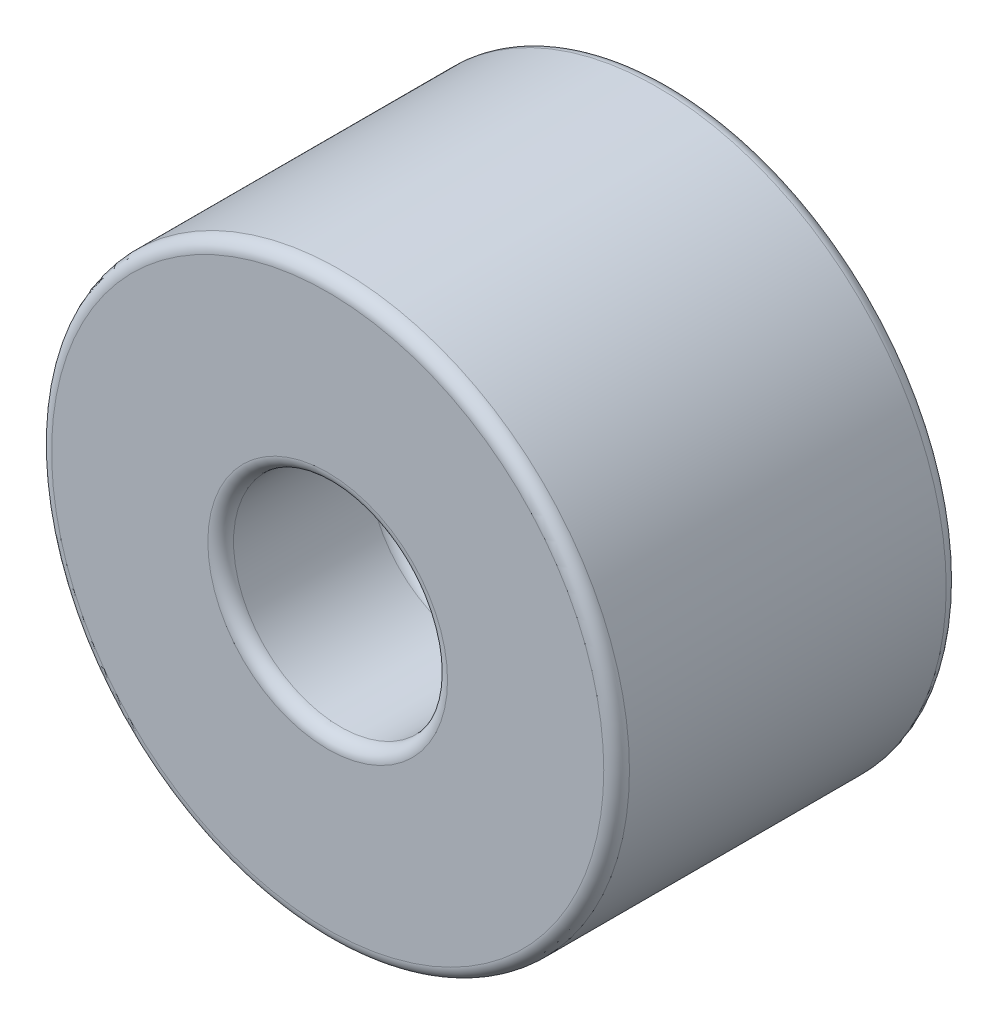
ISO-10303-21;
HEADER;
FILE_DESCRIPTION(('STEP AP214'),'2;1');
FILE_NAME('part.step','',(''),(''),'','','');
FILE_SCHEMA(('AUTOMOTIVE_DESIGN { 1 0 10303 214 1 1 1 1 }'));
ENDSEC;
DATA;
#1=APPLICATION_CONTEXT('core data for automotive mechanical design processes');
#2=APPLICATION_PROTOCOL_DEFINITION('international standard','automotive_design',2000,#1);
#3=PRODUCT_CONTEXT('',#1,'mechanical');
#4=PRODUCT('Part','Part','',(#3));
#5=PRODUCT_RELATED_PRODUCT_CATEGORY('part','',(#4));
#6=PRODUCT_DEFINITION_FORMATION('','',#4);
#7=PRODUCT_DEFINITION_CONTEXT('part definition',#1,'design');
#8=PRODUCT_DEFINITION('design','',#6,#7);
#9=PRODUCT_DEFINITION_SHAPE('','',#8);
#10=(LENGTH_UNIT() NAMED_UNIT(*) SI_UNIT(.MILLI.,.METRE.));
#11=(NAMED_UNIT(*) PLANE_ANGLE_UNIT() SI_UNIT($,.RADIAN.));
#12=(NAMED_UNIT(*) SI_UNIT($,.STERADIAN.) SOLID_ANGLE_UNIT());
#13=UNCERTAINTY_MEASURE_WITH_UNIT(LENGTH_MEASURE(1.E-05),#10,'distance_accuracy_value','');
#14=(GEOMETRIC_REPRESENTATION_CONTEXT(3) GLOBAL_UNCERTAINTY_ASSIGNED_CONTEXT((#13)) GLOBAL_UNIT_ASSIGNED_CONTEXT((#10,
#11,#12)) REPRESENTATION_CONTEXT('',''));
#15=CARTESIAN_POINT('',(0.,0.,0.));
#16=DIRECTION('',(0.,0.,1.));
#17=DIRECTION('',(1.,0.,0.));
#18=AXIS2_PLACEMENT_3D('',#15,#16,#17);
#19=CARTESIAN_POINT('',(0.,0.,160.));
#20=DIRECTION('',(0.,0.,-1.));
#21=DIRECTION('',(-1.,0.,0.));
#22=AXIS2_PLACEMENT_3D('',#19,#20,#21);
#23=CYLINDRICAL_SURFACE('',#22,135.);
#24=CARTESIAN_POINT('',(0.,0.,6.00000000000001));
#25=DIRECTION('',(0.,0.,1.));
#26=DIRECTION('',(1.,0.,0.));
#27=AXIS2_PLACEMENT_3D('',#24,#25,#26);
#28=CIRCLE('',#27,135.);
#29=CARTESIAN_POINT('',(135.,0.,6.00000000000001));
#30=VERTEX_POINT('',#29);
#31=EDGE_CURVE('E39',#30,#30,#28,.T.);
#32=ORIENTED_EDGE('',*,*,#31,.T.);
#33=EDGE_LOOP('',(#32));
#34=FACE_BOUND('',#33,.T.);
#35=CARTESIAN_POINT('',(0.,0.,154.));
#36=DIRECTION('',(0.,0.,1.));
#37=DIRECTION('',(1.,0.,0.));
#38=AXIS2_PLACEMENT_3D('',#35,#36,#37);
#39=CIRCLE('',#38,135.);
#40=CARTESIAN_POINT('',(135.,0.,154.));
#41=VERTEX_POINT('',#40);
#42=EDGE_CURVE('E44',#41,#41,#39,.F.);
#43=ORIENTED_EDGE('',*,*,#42,.T.);
#44=EDGE_LOOP('',(#43));
#45=FACE_BOUND('',#44,.T.);
#46=ADVANCED_FACE('F31',(#34,#45),#23,.T.);
#47=CARTESIAN_POINT('',(0.,0.,160.));
#48=DIRECTION('',(0.,0.,1.));
#49=DIRECTION('',(1.,0.,0.));
#50=AXIS2_PLACEMENT_3D('',#47,#48,#49);
#51=PLANE('',#50);
#52=CARTESIAN_POINT('',(0.,0.,160.));
#53=DIRECTION('',(0.,0.,1.));
#54=DIRECTION('',(1.,0.,0.));
#55=AXIS2_PLACEMENT_3D('',#52,#53,#54);
#56=CIRCLE('',#55,56.);
#57=CARTESIAN_POINT('',(56.,0.,160.));
#58=VERTEX_POINT('',#57);
#59=EDGE_CURVE('E81',#58,#58,#56,.F.);
#60=ORIENTED_EDGE('',*,*,#59,.T.);
#61=EDGE_LOOP('',(#60));
#62=FACE_BOUND('',#61,.T.);
#63=CARTESIAN_POINT('',(0.,0.,160.));
#64=DIRECTION('',(0.,0.,1.));
#65=DIRECTION('',(1.,0.,0.));
#66=AXIS2_PLACEMENT_3D('',#63,#64,#65);
#67=CIRCLE('',#66,129.);
#68=CARTESIAN_POINT('',(129.,0.,160.));
#69=VERTEX_POINT('',#68);
#70=EDGE_CURVE('E78',#69,#69,#67,.T.);
#71=ORIENTED_EDGE('',*,*,#70,.T.);
#72=EDGE_LOOP('',(#71));
#73=FACE_BOUND('',#72,.T.);
#74=ADVANCED_FACE('F108',(#62,#73),#51,.T.);
#75=CARTESIAN_POINT('',(0.,0.,0.));
#76=DIRECTION('',(0.,0.,1.));
#77=DIRECTION('',(1.,0.,0.));
#78=AXIS2_PLACEMENT_3D('',#75,#76,#77);
#79=PLANE('',#78);
#80=CARTESIAN_POINT('',(0.,0.,0.));
#81=DIRECTION('',(0.,0.,1.));
#82=DIRECTION('',(1.,0.,0.));
#83=AXIS2_PLACEMENT_3D('',#80,#81,#82);
#84=CIRCLE('',#83,56.);
#85=CARTESIAN_POINT('',(56.,0.,0.));
#86=VERTEX_POINT('',#85);
#87=EDGE_CURVE('E96',#86,#86,#84,.T.);
#88=ORIENTED_EDGE('',*,*,#87,.T.);
#89=EDGE_LOOP('',(#88));
#90=FACE_BOUND('',#89,.T.);
#91=CARTESIAN_POINT('',(0.,0.,0.));
#92=DIRECTION('',(0.,0.,1.));
#93=DIRECTION('',(1.,0.,0.));
#94=AXIS2_PLACEMENT_3D('',#91,#92,#93);
#95=CIRCLE('',#94,129.);
#96=CARTESIAN_POINT('',(129.,0.,0.));
#97=VERTEX_POINT('',#96);
#98=EDGE_CURVE('E93',#97,#97,#95,.F.);
#99=ORIENTED_EDGE('',*,*,#98,.T.);
#100=EDGE_LOOP('',(#99));
#101=FACE_BOUND('',#100,.T.);
#102=ADVANCED_FACE('F110',(#90,#101),#79,.F.);
#103=CARTESIAN_POINT('',(0.,0.,85.));
#104=DIRECTION('',(0.,0.,1.));
#105=DIRECTION('',(1.,0.,0.));
#106=AXIS2_PLACEMENT_3D('',#103,#104,#105);
#107=CYLINDRICAL_SURFACE('',#106,50.);
#108=CARTESIAN_POINT('',(0.,0.,154.));
#109=DIRECTION('',(0.,0.,1.));
#110=DIRECTION('',(1.,0.,0.));
#111=AXIS2_PLACEMENT_3D('',#108,#109,#110);
#112=CIRCLE('',#111,50.);
#113=CARTESIAN_POINT('',(50.,0.,154.));
#114=VERTEX_POINT('',#113);
#115=EDGE_CURVE('E75',#114,#114,#112,.T.);
#116=ORIENTED_EDGE('',*,*,#115,.T.);
#117=EDGE_LOOP('',(#116));
#118=FACE_BOUND('',#117,.T.);
#119=CARTESIAN_POINT('',(0.,0.,91.));
#120=DIRECTION('',(0.,0.,1.));
#121=DIRECTION('',(1.,0.,0.));
#122=AXIS2_PLACEMENT_3D('',#119,#120,#121);
#123=CIRCLE('',#122,50.);
#124=CARTESIAN_POINT('',(50.,0.,91.));
#125=VERTEX_POINT('',#124);
#126=EDGE_CURVE('E51',#125,#125,#123,.F.);
#127=ORIENTED_EDGE('',*,*,#126,.T.);
#128=EDGE_LOOP('',(#127));
#129=FACE_BOUND('',#128,.T.);
#130=ADVANCED_FACE('F117',(#118,#129),#107,.F.);
#131=CARTESIAN_POINT('',(0.,0.,85.));
#132=DIRECTION('',(0.,0.,1.));
#133=DIRECTION('',(1.,0.,0.));
#134=AXIS2_PLACEMENT_3D('',#131,#132,#133);
#135=PLANE('',#134);
#136=CARTESIAN_POINT('',(0.,0.,85.));
#137=DIRECTION('',(0.,0.,1.));
#138=DIRECTION('',(1.,0.,0.));
#139=AXIS2_PLACEMENT_3D('',#136,#137,#138);
#140=CIRCLE('',#139,6.5);
#141=CARTESIAN_POINT('',(6.5,0.,85.));
#142=VERTEX_POINT('',#141);
#143=EDGE_CURVE('E68',#142,#142,#140,.T.);
#144=ORIENTED_EDGE('',*,*,#143,.F.);
#145=EDGE_LOOP('',(#144));
#146=FACE_BOUND('',#145,.T.);
#147=CARTESIAN_POINT('',(-17.4999999999997,30.3108891324555,85.));
#148=DIRECTION('',(0.,0.,1.));
#149=DIRECTION('',(1.,0.,0.));
#150=AXIS2_PLACEMENT_3D('',#147,#148,#149);
#151=CIRCLE('',#150,4.00000000000001);
#152=CARTESIAN_POINT('',(-13.4999999999997,30.3108891324555,85.));
#153=VERTEX_POINT('',#152);
#154=EDGE_CURVE('E58',#153,#153,#151,.T.);
#155=ORIENTED_EDGE('',*,*,#154,.F.);
#156=EDGE_LOOP('',(#155));
#157=FACE_BOUND('',#156,.T.);
#158=CARTESIAN_POINT('',(-17.5000000000001,-30.3108891324553,85.));
#159=DIRECTION('',(0.,0.,1.));
#160=DIRECTION('',(1.,0.,0.));
#161=AXIS2_PLACEMENT_3D('',#158,#159,#160);
#162=CIRCLE('',#161,4.00000000000001);
#163=CARTESIAN_POINT('',(-13.5000000000001,-30.3108891324553,85.));
#164=VERTEX_POINT('',#163);
#165=EDGE_CURVE('E55',#164,#164,#162,.T.);
#166=ORIENTED_EDGE('',*,*,#165,.F.);
#167=EDGE_LOOP('',(#166));
#168=FACE_BOUND('',#167,.T.);
#169=CARTESIAN_POINT('',(35.,0.,85.));
#170=DIRECTION('',(0.,0.,1.));
#171=DIRECTION('',(1.,0.,0.));
#172=AXIS2_PLACEMENT_3D('',#169,#170,#171);
#173=CIRCLE('',#172,4.00000000000001);
#174=CARTESIAN_POINT('',(39.,0.,85.));
#175=VERTEX_POINT('',#174);
#176=EDGE_CURVE('E52',#175,#175,#173,.T.);
#177=ORIENTED_EDGE('',*,*,#176,.F.);
#178=EDGE_LOOP('',(#177));
#179=FACE_BOUND('',#178,.T.);
#180=CARTESIAN_POINT('',(0.,0.,85.));
#181=DIRECTION('',(0.,0.,1.));
#182=DIRECTION('',(1.,0.,0.));
#183=AXIS2_PLACEMENT_3D('',#180,#181,#182);
#184=CIRCLE('',#183,44.);
#185=CARTESIAN_POINT('',(44.,0.,85.));
#186=VERTEX_POINT('',#185);
#187=EDGE_CURVE('E84',#186,#186,#184,.T.);
#188=ORIENTED_EDGE('',*,*,#187,.T.);
#189=EDGE_LOOP('',(#188));
#190=FACE_BOUND('',#189,.T.);
#191=ADVANCED_FACE('F207',(#146,#157,#168,#179,#190),#135,.T.);
#192=CARTESIAN_POINT('',(0.,0.,75.));
#193=DIRECTION('',(0.,0.,-1.));
#194=DIRECTION('',(-1.,0.,0.));
#195=AXIS2_PLACEMENT_3D('',#192,#193,#194);
#196=CYLINDRICAL_SURFACE('',#195,50.);
#197=CARTESIAN_POINT('',(0.,0.,6.00000000000001));
#198=DIRECTION('',(0.,0.,1.));
#199=DIRECTION('',(1.,0.,0.));
#200=AXIS2_PLACEMENT_3D('',#197,#198,#199);
#201=CIRCLE('',#200,50.);
#202=CARTESIAN_POINT('',(50.,0.,6.00000000000001));
#203=VERTEX_POINT('',#202);
#204=EDGE_CURVE('E90',#203,#203,#201,.F.);
#205=ORIENTED_EDGE('',*,*,#204,.T.);
#206=EDGE_LOOP('',(#205));
#207=FACE_BOUND('',#206,.T.);
#208=CARTESIAN_POINT('',(0.,0.,69.));
#209=DIRECTION('',(0.,0.,-1.));
#210=DIRECTION('',(-1.,0.,0.));
#211=AXIS2_PLACEMENT_3D('',#208,#209,#210);
#212=CIRCLE('',#211,50.);
#213=CARTESIAN_POINT('',(-50.,0.,69.));
#214=VERTEX_POINT('',#213);
#215=EDGE_CURVE('E87',#214,#214,#212,.F.);
#216=ORIENTED_EDGE('',*,*,#215,.T.);
#217=EDGE_LOOP('',(#216));
#218=FACE_BOUND('',#217,.T.);
#219=ADVANCED_FACE('F198',(#207,#218),#196,.F.);
#220=CARTESIAN_POINT('',(0.,0.,75.));
#221=DIRECTION('',(0.,0.,-1.));
#222=DIRECTION('',(-1.,0.,0.));
#223=AXIS2_PLACEMENT_3D('',#220,#221,#222);
#224=PLANE('',#223);
#225=CARTESIAN_POINT('',(0.,0.,75.));
#226=DIRECTION('',(0.,0.,-1.));
#227=DIRECTION('',(-1.,0.,0.));
#228=AXIS2_PLACEMENT_3D('',#225,#226,#227);
#229=CIRCLE('',#228,6.5);
#230=CARTESIAN_POINT('',(-6.5,0.,75.));
#231=VERTEX_POINT('',#230);
#232=EDGE_CURVE('E35',#231,#231,#229,.T.);
#233=ORIENTED_EDGE('',*,*,#232,.F.);
#234=EDGE_LOOP('',(#233));
#235=FACE_BOUND('',#234,.T.);
#236=CARTESIAN_POINT('',(-17.4999999999997,30.3108891324555,75.));
#237=DIRECTION('',(0.,0.,-1.));
#238=DIRECTION('',(-1.,0.,0.));
#239=AXIS2_PLACEMENT_3D('',#236,#237,#238);
#240=CIRCLE('',#239,4.00000000000001);
#241=CARTESIAN_POINT('',(-21.4999999999997,30.3108891324555,75.));
#242=VERTEX_POINT('',#241);
#243=EDGE_CURVE('E56',#242,#242,#240,.T.);
#244=ORIENTED_EDGE('',*,*,#243,.F.);
#245=EDGE_LOOP('',(#244));
#246=FACE_BOUND('',#245,.T.);
#247=CARTESIAN_POINT('',(-17.5000000000001,-30.3108891324553,75.));
#248=DIRECTION('',(0.,0.,-1.));
#249=DIRECTION('',(-1.,0.,0.));
#250=AXIS2_PLACEMENT_3D('',#247,#248,#249);
#251=CIRCLE('',#250,4.00000000000001);
#252=CARTESIAN_POINT('',(-21.5000000000002,-30.3108891324553,75.));
#253=VERTEX_POINT('',#252);
#254=EDGE_CURVE('E53',#253,#253,#251,.T.);
#255=ORIENTED_EDGE('',*,*,#254,.F.);
#256=EDGE_LOOP('',(#255));
#257=FACE_BOUND('',#256,.T.);
#258=CARTESIAN_POINT('',(35.,0.,75.));
#259=DIRECTION('',(0.,0.,-1.));
#260=DIRECTION('',(-1.,0.,0.));
#261=AXIS2_PLACEMENT_3D('',#258,#259,#260);
#262=CIRCLE('',#261,4.00000000000001);
#263=CARTESIAN_POINT('',(31.,0.,75.));
#264=VERTEX_POINT('',#263);
#265=EDGE_CURVE('E48',#264,#264,#262,.T.);
#266=ORIENTED_EDGE('',*,*,#265,.F.);
#267=EDGE_LOOP('',(#266));
#268=FACE_BOUND('',#267,.T.);
#269=CARTESIAN_POINT('',(0.,0.,75.));
#270=DIRECTION('',(0.,0.,-1.));
#271=DIRECTION('',(-1.,0.,0.));
#272=AXIS2_PLACEMENT_3D('',#269,#270,#271);
#273=CIRCLE('',#272,44.);
#274=CARTESIAN_POINT('',(-44.,0.,75.));
#275=VERTEX_POINT('',#274);
#276=EDGE_CURVE('E10',#275,#275,#273,.T.);
#277=ORIENTED_EDGE('',*,*,#276,.T.);
#278=EDGE_LOOP('',(#277));
#279=FACE_BOUND('',#278,.T.);
#280=ADVANCED_FACE('F129',(#235,#246,#257,#268,#279),#224,.T.);
#281=CARTESIAN_POINT('',(0.,0.,154.));
#282=DIRECTION('',(0.,0.,1.));
#283=DIRECTION('',(1.,0.,0.));
#284=AXIS2_PLACEMENT_3D('',#281,#282,#283);
#285=TOROIDAL_SURFACE('',#284,56.,6.);
#286=ORIENTED_EDGE('',*,*,#59,.F.);
#287=EDGE_LOOP('',(#286));
#288=FACE_BOUND('',#287,.T.);
#289=ORIENTED_EDGE('',*,*,#115,.F.);
#290=EDGE_LOOP('',(#289));
#291=FACE_BOUND('',#290,.T.);
#292=ADVANCED_FACE('F125',(#288,#291),#285,.T.);
#293=CARTESIAN_POINT('',(0.,0.,91.));
#294=DIRECTION('',(0.,0.,1.));
#295=DIRECTION('',(1.,0.,0.));
#296=AXIS2_PLACEMENT_3D('',#293,#294,#295);
#297=TOROIDAL_SURFACE('',#296,44.,6.);
#298=ORIENTED_EDGE('',*,*,#126,.F.);
#299=EDGE_LOOP('',(#298));
#300=FACE_BOUND('',#299,.T.);
#301=ORIENTED_EDGE('',*,*,#187,.F.);
#302=EDGE_LOOP('',(#301));
#303=FACE_BOUND('',#302,.T.);
#304=ADVANCED_FACE('F128',(#300,#303),#297,.F.);
#305=CARTESIAN_POINT('',(0.,0.,6.00000000000001));
#306=DIRECTION('',(0.,0.,1.));
#307=DIRECTION('',(1.,0.,0.));
#308=AXIS2_PLACEMENT_3D('',#305,#306,#307);
#309=TOROIDAL_SURFACE('',#308,56.,6.);
#310=ORIENTED_EDGE('',*,*,#87,.F.);
#311=EDGE_LOOP('',(#310));
#312=FACE_BOUND('',#311,.T.);
#313=ORIENTED_EDGE('',*,*,#204,.F.);
#314=EDGE_LOOP('',(#313));
#315=FACE_BOUND('',#314,.T.);
#316=ADVANCED_FACE('F133',(#312,#315),#309,.T.);
#317=CARTESIAN_POINT('',(0.,0.,6.00000000000001));
#318=DIRECTION('',(0.,0.,1.));
#319=DIRECTION('',(1.,0.,0.));
#320=AXIS2_PLACEMENT_3D('',#317,#318,#319);
#321=TOROIDAL_SURFACE('',#320,129.,6.);
#322=ORIENTED_EDGE('',*,*,#98,.F.);
#323=EDGE_LOOP('',(#322));
#324=FACE_BOUND('',#323,.T.);
#325=ORIENTED_EDGE('',*,*,#31,.F.);
#326=EDGE_LOOP('',(#325));
#327=FACE_BOUND('',#326,.T.);
#328=ADVANCED_FACE('F105',(#324,#327),#321,.T.);
#329=CARTESIAN_POINT('',(0.,0.,154.));
#330=DIRECTION('',(0.,0.,1.));
#331=DIRECTION('',(1.,0.,0.));
#332=AXIS2_PLACEMENT_3D('',#329,#330,#331);
#333=TOROIDAL_SURFACE('',#332,129.,6.);
#334=ORIENTED_EDGE('',*,*,#42,.F.);
#335=EDGE_LOOP('',(#334));
#336=FACE_BOUND('',#335,.T.);
#337=ORIENTED_EDGE('',*,*,#70,.F.);
#338=EDGE_LOOP('',(#337));
#339=FACE_BOUND('',#338,.T.);
#340=ADVANCED_FACE('F102',(#336,#339),#333,.T.);
#341=CARTESIAN_POINT('',(0.,0.,69.));
#342=DIRECTION('',(0.,0.,-1.));
#343=DIRECTION('',(-1.,0.,0.));
#344=AXIS2_PLACEMENT_3D('',#341,#342,#343);
#345=TOROIDAL_SURFACE('',#344,44.,6.);
#346=ORIENTED_EDGE('',*,*,#215,.F.);
#347=EDGE_LOOP('',(#346));
#348=FACE_BOUND('',#347,.T.);
#349=ORIENTED_EDGE('',*,*,#276,.F.);
#350=EDGE_LOOP('',(#349));
#351=FACE_BOUND('',#350,.T.);
#352=ADVANCED_FACE('F33',(#348,#351),#345,.F.);
#353=CARTESIAN_POINT('',(35.,0.,40.));
#354=DIRECTION('',(0.,0.,1.));
#355=DIRECTION('',(1.,0.,0.));
#356=AXIS2_PLACEMENT_3D('',#353,#354,#355);
#357=CYLINDRICAL_SURFACE('',#356,4.00000000000001);
#358=ORIENTED_EDGE('',*,*,#265,.T.);
#359=EDGE_LOOP('',(#358));
#360=FACE_BOUND('',#359,.T.);
#361=ORIENTED_EDGE('',*,*,#176,.T.);
#362=EDGE_LOOP('',(#361));
#363=FACE_BOUND('',#362,.T.);
#364=ADVANCED_FACE('F158',(#360,#363),#357,.F.);
#365=CARTESIAN_POINT('',(-17.5000000000001,-30.3108891324553,40.));
#366=DIRECTION('',(0.,0.,1.));
#367=DIRECTION('',(1.,0.,0.));
#368=AXIS2_PLACEMENT_3D('',#365,#366,#367);
#369=CYLINDRICAL_SURFACE('',#368,4.00000000000001);
#370=ORIENTED_EDGE('',*,*,#254,.T.);
#371=EDGE_LOOP('',(#370));
#372=FACE_BOUND('',#371,.T.);
#373=ORIENTED_EDGE('',*,*,#165,.T.);
#374=EDGE_LOOP('',(#373));
#375=FACE_BOUND('',#374,.T.);
#376=ADVANCED_FACE('F165',(#372,#375),#369,.F.);
#377=CARTESIAN_POINT('',(-17.4999999999997,30.3108891324555,40.));
#378=DIRECTION('',(0.,0.,1.));
#379=DIRECTION('',(1.,0.,0.));
#380=AXIS2_PLACEMENT_3D('',#377,#378,#379);
#381=CYLINDRICAL_SURFACE('',#380,4.00000000000001);
#382=ORIENTED_EDGE('',*,*,#243,.T.);
#383=EDGE_LOOP('',(#382));
#384=FACE_BOUND('',#383,.T.);
#385=ORIENTED_EDGE('',*,*,#154,.T.);
#386=EDGE_LOOP('',(#385));
#387=FACE_BOUND('',#386,.T.);
#388=ADVANCED_FACE('F173',(#384,#387),#381,.F.);
#389=CARTESIAN_POINT('',(0.,0.,0.));
#390=DIRECTION('',(0.,0.,1.));
#391=DIRECTION('',(1.,0.,0.));
#392=AXIS2_PLACEMENT_3D('',#389,#390,#391);
#393=CYLINDRICAL_SURFACE('',#392,6.5);
#394=ORIENTED_EDGE('',*,*,#232,.T.);
#395=EDGE_LOOP('',(#394));
#396=FACE_BOUND('',#395,.T.);
#397=ORIENTED_EDGE('',*,*,#143,.T.);
#398=EDGE_LOOP('',(#397));
#399=FACE_BOUND('',#398,.T.);
#400=ADVANCED_FACE('F181',(#396,#399),#393,.F.);
#401=CLOSED_SHELL('',(#46,#74,#102,#130,#191,#219,#280,#292,#304,#316,#328,#340,#352,#364,#376,
#388,#400));
#402=MANIFOLD_SOLID_BREP('B2',#401);
#403=ADVANCED_BREP_SHAPE_REPRESENTATION('',(#18,#402),#14);
#404=SHAPE_DEFINITION_REPRESENTATION(#9,#403);
ENDSEC;
END-ISO-10303-21;
